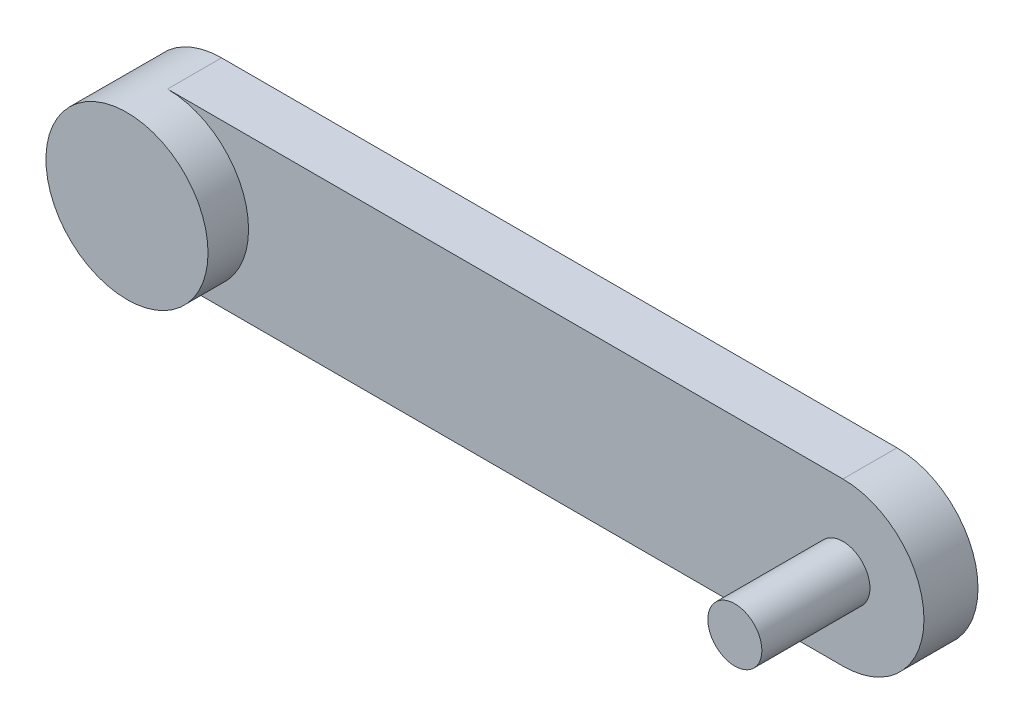
ISO-10303-21;
HEADER;
FILE_DESCRIPTION(('STEP AP214'),'2;1');
FILE_NAME('part.step','',(''),(''),'','','');
FILE_SCHEMA(('AUTOMOTIVE_DESIGN { 1 0 10303 214 1 1 1 1 }'));
ENDSEC;
DATA;
#1=APPLICATION_CONTEXT('core data for automotive mechanical design processes');
#2=APPLICATION_PROTOCOL_DEFINITION('international standard','automotive_design',2000,#1);
#3=PRODUCT_CONTEXT('',#1,'mechanical');
#4=PRODUCT('Part','Part','',(#3));
#5=PRODUCT_RELATED_PRODUCT_CATEGORY('part','',(#4));
#6=PRODUCT_DEFINITION_FORMATION('','',#4);
#7=PRODUCT_DEFINITION_CONTEXT('part definition',#1,'design');
#8=PRODUCT_DEFINITION('design','',#6,#7);
#9=PRODUCT_DEFINITION_SHAPE('','',#8);
#10=(LENGTH_UNIT() NAMED_UNIT(*) SI_UNIT(.MILLI.,.METRE.));
#11=(NAMED_UNIT(*) PLANE_ANGLE_UNIT() SI_UNIT($,.RADIAN.));
#12=(NAMED_UNIT(*) SI_UNIT($,.STERADIAN.) SOLID_ANGLE_UNIT());
#13=UNCERTAINTY_MEASURE_WITH_UNIT(LENGTH_MEASURE(1.E-05),#10,'distance_accuracy_value','');
#14=(GEOMETRIC_REPRESENTATION_CONTEXT(3) GLOBAL_UNCERTAINTY_ASSIGNED_CONTEXT((#13)) GLOBAL_UNIT_ASSIGNED_CONTEXT((#10,
#11,#12)) REPRESENTATION_CONTEXT('',''));
#15=CARTESIAN_POINT('',(0.,0.,0.));
#16=DIRECTION('',(0.,0.,1.));
#17=DIRECTION('',(1.,0.,0.));
#18=AXIS2_PLACEMENT_3D('',#15,#16,#17);
#19=CARTESIAN_POINT('',(-125.,0.,10.));
#20=DIRECTION('',(0.,0.,1.));
#21=DIRECTION('',(1.,0.,0.));
#22=AXIS2_PLACEMENT_3D('',#19,#20,#21);
#23=PLANE('',#22);
#24=CARTESIAN_POINT('',(125.,0.,10.));
#25=DIRECTION('',(0.,0.,1.));
#26=DIRECTION('',(1.,0.,0.));
#27=AXIS2_PLACEMENT_3D('',#24,#25,#26);
#28=CIRCLE('',#27,9.99999999999998);
#29=CARTESIAN_POINT('',(135.,0.,10.));
#30=VERTEX_POINT('',#29);
#31=EDGE_CURVE('E98',#30,#30,#28,.T.);
#32=ORIENTED_EDGE('',*,*,#31,.F.);
#33=EDGE_LOOP('',(#32));
#34=FACE_BOUND('',#33,.T.);
#35=CARTESIAN_POINT('',(-125.,0.,10.));
#36=DIRECTION('',(0.,0.,1.));
#37=DIRECTION('',(1.,0.,0.));
#38=AXIS2_PLACEMENT_3D('',#35,#36,#37);
#39=CIRCLE('',#38,30.);
#40=CARTESIAN_POINT('',(-125.,-30.,10.));
#41=VERTEX_POINT('',#40);
#42=CARTESIAN_POINT('',(-125.,30.,10.));
#43=VERTEX_POINT('',#42);
#44=EDGE_CURVE('E10',#41,#43,#39,.T.);
#45=ORIENTED_EDGE('',*,*,#44,.F.);
#46=DIRECTION('',(1.,0.,0.));
#47=VECTOR('',#46,1.);
#48=CARTESIAN_POINT('',(-125.,-30.,10.));
#49=LINE('',#48,#47);
#50=CARTESIAN_POINT('',(125.,-30.,10.));
#51=VERTEX_POINT('',#50);
#52=EDGE_CURVE('E81',#41,#51,#49,.T.);
#53=ORIENTED_EDGE('',*,*,#52,.T.);
#54=CARTESIAN_POINT('',(125.,0.,10.));
#55=DIRECTION('',(0.,0.,1.));
#56=DIRECTION('',(-1.,0.,0.));
#57=AXIS2_PLACEMENT_3D('',#54,#55,#56);
#58=CIRCLE('',#57,30.);
#59=CARTESIAN_POINT('',(125.,30.,10.));
#60=VERTEX_POINT('',#59);
#61=EDGE_CURVE('E33',#51,#60,#58,.T.);
#62=ORIENTED_EDGE('',*,*,#61,.T.);
#63=DIRECTION('',(-1.,0.,0.));
#64=VECTOR('',#63,1.);
#65=CARTESIAN_POINT('',(-125.,30.,10.));
#66=LINE('',#65,#64);
#67=EDGE_CURVE('E64',#60,#43,#66,.T.);
#68=ORIENTED_EDGE('',*,*,#67,.T.);
#69=EDGE_LOOP('',(#45,#53,#62,#68));
#70=FACE_BOUND('',#69,.T.);
#71=ADVANCED_FACE('F15',(#34,#70),#23,.T.);
#72=CARTESIAN_POINT('',(-125.,0.,-10.));
#73=DIRECTION('',(0.,0.,1.));
#74=DIRECTION('',(1.,0.,0.));
#75=AXIS2_PLACEMENT_3D('',#72,#73,#74);
#76=PLANE('',#75);
#77=CARTESIAN_POINT('',(-125.,0.,-10.));
#78=DIRECTION('',(0.,0.,1.));
#79=DIRECTION('',(1.,0.,0.));
#80=AXIS2_PLACEMENT_3D('',#77,#78,#79);
#81=CIRCLE('',#80,30.);
#82=CARTESIAN_POINT('',(-125.,30.,-10.));
#83=VERTEX_POINT('',#82);
#84=CARTESIAN_POINT('',(-125.,-30.,-10.));
#85=VERTEX_POINT('',#84);
#86=EDGE_CURVE('E74',#83,#85,#81,.T.);
#87=ORIENTED_EDGE('',*,*,#86,.F.);
#88=DIRECTION('',(-1.,0.,0.));
#89=VECTOR('',#88,1.);
#90=CARTESIAN_POINT('',(-125.,30.,-10.));
#91=LINE('',#90,#89);
#92=CARTESIAN_POINT('',(125.,30.,-10.));
#93=VERTEX_POINT('',#92);
#94=EDGE_CURVE('E56',#93,#83,#91,.T.);
#95=ORIENTED_EDGE('',*,*,#94,.F.);
#96=CARTESIAN_POINT('',(125.,0.,-10.));
#97=DIRECTION('',(0.,0.,1.));
#98=DIRECTION('',(-1.,0.,0.));
#99=AXIS2_PLACEMENT_3D('',#96,#97,#98);
#100=CIRCLE('',#99,30.);
#101=CARTESIAN_POINT('',(125.,-30.,-10.));
#102=VERTEX_POINT('',#101);
#103=EDGE_CURVE('E50',#102,#93,#100,.T.);
#104=ORIENTED_EDGE('',*,*,#103,.F.);
#105=DIRECTION('',(1.,0.,0.));
#106=VECTOR('',#105,1.);
#107=CARTESIAN_POINT('',(-125.,-30.,-10.));
#108=LINE('',#107,#106);
#109=EDGE_CURVE('E83',#85,#102,#108,.T.);
#110=ORIENTED_EDGE('',*,*,#109,.F.);
#111=EDGE_LOOP('',(#87,#95,#104,#110));
#112=FACE_BOUND('',#111,.T.);
#113=CARTESIAN_POINT('',(-125.,0.,-10.));
#114=DIRECTION('',(0.,0.,1.));
#115=DIRECTION('',(1.,0.,0.));
#116=AXIS2_PLACEMENT_3D('',#113,#114,#115);
#117=CIRCLE('',#116,9.84258704865271);
#118=CARTESIAN_POINT('',(-115.157412951347,0.,-10.));
#119=VERTEX_POINT('',#118);
#120=EDGE_CURVE('E85',#119,#119,#117,.T.);
#121=ORIENTED_EDGE('',*,*,#120,.T.);
#122=EDGE_LOOP('',(#121));
#123=FACE_BOUND('',#122,.T.);
#124=ADVANCED_FACE('F114',(#112,#123),#76,.F.);
#125=CARTESIAN_POINT('',(-125.,0.,10.));
#126=DIRECTION('',(0.,0.,-1.));
#127=DIRECTION('',(-1.,0.,0.));
#128=AXIS2_PLACEMENT_3D('',#125,#126,#127);
#129=CYLINDRICAL_SURFACE('',#128,30.);
#130=ORIENTED_EDGE('',*,*,#86,.T.);
#131=DIRECTION('',(0.,0.,-1.));
#132=VECTOR('',#131,1.);
#133=CARTESIAN_POINT('',(-125.,-30.,10.));
#134=LINE('',#133,#132);
#135=EDGE_CURVE('E19',#41,#85,#134,.T.);
#136=ORIENTED_EDGE('',*,*,#135,.F.);
#137=ORIENTED_EDGE('',*,*,#44,.T.);
#138=DIRECTION('',(0.,0.,-1.));
#139=VECTOR('',#138,1.);
#140=CARTESIAN_POINT('',(-125.,30.,10.));
#141=LINE('',#140,#139);
#142=EDGE_CURVE('E62',#43,#83,#141,.T.);
#143=ORIENTED_EDGE('',*,*,#142,.T.);
#144=EDGE_LOOP('',(#130,#136,#137,#143));
#145=FACE_BOUND('',#144,.T.);
#146=CARTESIAN_POINT('',(-125.,0.,25.));
#147=DIRECTION('',(0.,0.,1.));
#148=DIRECTION('',(1.,0.,0.));
#149=AXIS2_PLACEMENT_3D('',#146,#147,#148);
#150=CIRCLE('',#149,30.);
#151=CARTESIAN_POINT('',(-95.,0.,25.));
#152=VERTEX_POINT('',#151);
#153=EDGE_CURVE('E93',#152,#152,#150,.T.);
#154=ORIENTED_EDGE('',*,*,#153,.F.);
#155=EDGE_LOOP('',(#154));
#156=FACE_BOUND('',#155,.T.);
#157=ADVANCED_FACE('F17',(#145,#156),#129,.T.);
#158=CARTESIAN_POINT('',(-125.,-30.,10.));
#159=DIRECTION('',(0.,1.,0.));
#160=DIRECTION('',(-1.,0.,0.));
#161=AXIS2_PLACEMENT_3D('',#158,#159,#160);
#162=PLANE('',#161);
#163=ORIENTED_EDGE('',*,*,#109,.T.);
#164=DIRECTION('',(0.,0.,-1.));
#165=VECTOR('',#164,1.);
#166=CARTESIAN_POINT('',(125.,-30.,10.));
#167=LINE('',#166,#165);
#168=EDGE_CURVE('E76',#51,#102,#167,.T.);
#169=ORIENTED_EDGE('',*,*,#168,.F.);
#170=ORIENTED_EDGE('',*,*,#52,.F.);
#171=ORIENTED_EDGE('',*,*,#135,.T.);
#172=EDGE_LOOP('',(#163,#169,#170,#171));
#173=FACE_BOUND('',#172,.T.);
#174=ADVANCED_FACE('F130',(#173),#162,.F.);
#175=CARTESIAN_POINT('',(125.,0.,10.));
#176=DIRECTION('',(0.,0.,-1.));
#177=DIRECTION('',(-1.,0.,0.));
#178=AXIS2_PLACEMENT_3D('',#175,#176,#177);
#179=CYLINDRICAL_SURFACE('',#178,30.);
#180=ORIENTED_EDGE('',*,*,#103,.T.);
#181=DIRECTION('',(0.,0.,-1.));
#182=VECTOR('',#181,1.);
#183=CARTESIAN_POINT('',(125.,30.,10.));
#184=LINE('',#183,#182);
#185=EDGE_CURVE('E68',#60,#93,#184,.T.);
#186=ORIENTED_EDGE('',*,*,#185,.F.);
#187=ORIENTED_EDGE('',*,*,#61,.F.);
#188=ORIENTED_EDGE('',*,*,#168,.T.);
#189=EDGE_LOOP('',(#180,#186,#187,#188));
#190=FACE_BOUND('',#189,.T.);
#191=ADVANCED_FACE('F128',(#190),#179,.T.);
#192=CARTESIAN_POINT('',(-125.,30.,10.));
#193=DIRECTION('',(0.,-1.,0.));
#194=DIRECTION('',(1.,0.,0.));
#195=AXIS2_PLACEMENT_3D('',#192,#193,#194);
#196=PLANE('',#195);
#197=ORIENTED_EDGE('',*,*,#94,.T.);
#198=ORIENTED_EDGE('',*,*,#142,.F.);
#199=ORIENTED_EDGE('',*,*,#67,.F.);
#200=ORIENTED_EDGE('',*,*,#185,.T.);
#201=EDGE_LOOP('',(#197,#198,#199,#200));
#202=FACE_BOUND('',#201,.T.);
#203=ADVANCED_FACE('F63',(#202),#196,.F.);
#204=CARTESIAN_POINT('',(-125.,0.,10.));
#205=DIRECTION('',(0.,0.,-1.));
#206=DIRECTION('',(-1.,0.,0.));
#207=AXIS2_PLACEMENT_3D('',#204,#205,#206);
#208=CYLINDRICAL_SURFACE('',#207,9.84258704865271);
#209=CARTESIAN_POINT('',(-125.,0.,10.));
#210=DIRECTION('',(0.,0.,1.));
#211=DIRECTION('',(1.,0.,0.));
#212=AXIS2_PLACEMENT_3D('',#209,#210,#211);
#213=CIRCLE('',#212,9.84258704865271);
#214=CARTESIAN_POINT('',(-115.157412951347,0.,10.));
#215=VERTEX_POINT('',#214);
#216=EDGE_CURVE('E91',#215,#215,#213,.T.);
#217=ORIENTED_EDGE('',*,*,#216,.T.);
#218=EDGE_LOOP('',(#217));
#219=FACE_BOUND('',#218,.T.);
#220=ORIENTED_EDGE('',*,*,#120,.F.);
#221=EDGE_LOOP('',(#220));
#222=FACE_BOUND('',#221,.T.);
#223=ADVANCED_FACE('F123',(#219,#222),#208,.F.);
#224=CARTESIAN_POINT('',(-125.,0.,25.));
#225=DIRECTION('',(0.,0.,1.));
#226=DIRECTION('',(1.,0.,0.));
#227=AXIS2_PLACEMENT_3D('',#224,#225,#226);
#228=PLANE('',#227);
#229=ORIENTED_EDGE('',*,*,#153,.T.);
#230=EDGE_LOOP('',(#229));
#231=FACE_BOUND('',#230,.T.);
#232=ADVANCED_FACE('F139',(#231),#228,.T.);
#233=CARTESIAN_POINT('',(-125.,0.,10.));
#234=DIRECTION('',(0.,0.,1.));
#235=DIRECTION('',(1.,0.,0.));
#236=AXIS2_PLACEMENT_3D('',#233,#234,#235);
#237=PLANE('',#236);
#238=ORIENTED_EDGE('',*,*,#216,.F.);
#239=EDGE_LOOP('',(#238));
#240=FACE_BOUND('',#239,.T.);
#241=ADVANCED_FACE('F109',(#240),#237,.F.);
#242=CARTESIAN_POINT('',(125.,0.,50.));
#243=DIRECTION('',(0.,0.,-1.));
#244=DIRECTION('',(-1.,0.,0.));
#245=AXIS2_PLACEMENT_3D('',#242,#243,#244);
#246=CYLINDRICAL_SURFACE('',#245,9.99999999999998);
#247=CARTESIAN_POINT('',(125.,0.,50.));
#248=DIRECTION('',(0.,0.,1.));
#249=DIRECTION('',(1.,0.,0.));
#250=AXIS2_PLACEMENT_3D('',#247,#248,#249);
#251=CIRCLE('',#250,9.99999999999998);
#252=CARTESIAN_POINT('',(135.,0.,50.));
#253=VERTEX_POINT('',#252);
#254=EDGE_CURVE('E97',#253,#253,#251,.T.);
#255=ORIENTED_EDGE('',*,*,#254,.F.);
#256=EDGE_LOOP('',(#255));
#257=FACE_BOUND('',#256,.T.);
#258=ORIENTED_EDGE('',*,*,#31,.T.);
#259=EDGE_LOOP('',(#258));
#260=FACE_BOUND('',#259,.T.);
#261=ADVANCED_FACE('F106',(#257,#260),#246,.T.);
#262=CARTESIAN_POINT('',(125.,0.,50.));
#263=DIRECTION('',(0.,0.,1.));
#264=DIRECTION('',(1.,0.,0.));
#265=AXIS2_PLACEMENT_3D('',#262,#263,#264);
#266=PLANE('',#265);
#267=ORIENTED_EDGE('',*,*,#254,.T.);
#268=EDGE_LOOP('',(#267));
#269=FACE_BOUND('',#268,.T.);
#270=ADVANCED_FACE('F104',(#269),#266,.T.);
#271=CLOSED_SHELL('',(#71,#124,#157,#174,#191,#203,#223,#232,#241,#261,#270));
#272=MANIFOLD_SOLID_BREP('B1',#271);
#273=ADVANCED_BREP_SHAPE_REPRESENTATION('',(#18,#272),#14);
#274=SHAPE_DEFINITION_REPRESENTATION(#9,#273);
ENDSEC;
END-ISO-10303-21;
